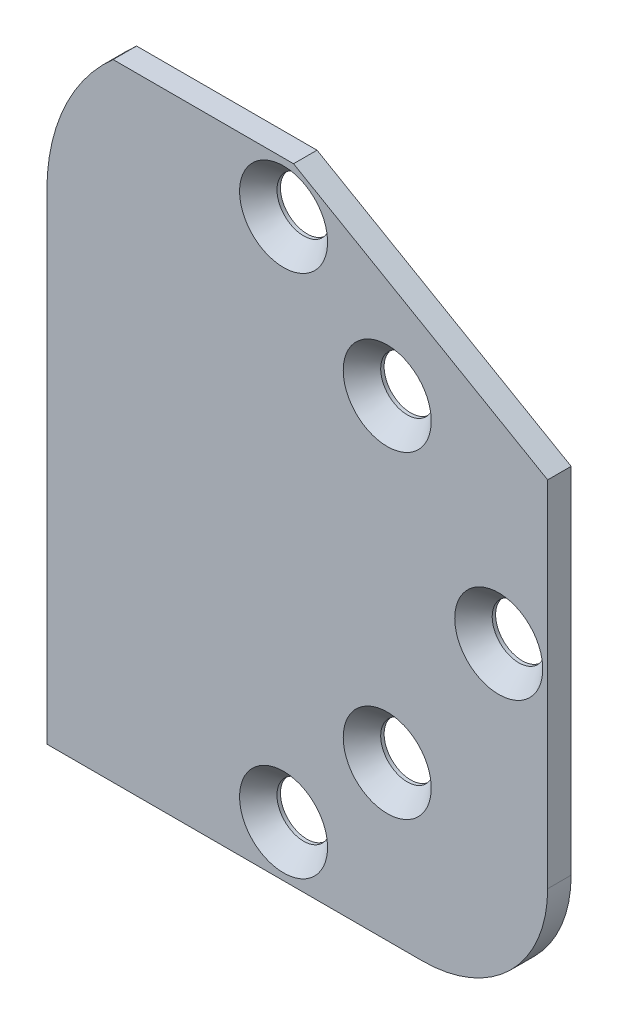
ISO-10303-21;
HEADER;
FILE_DESCRIPTION(('STEP AP214'),'2;1');
FILE_NAME('part.step','',(''),(''),'','','');
FILE_SCHEMA(('AUTOMOTIVE_DESIGN { 1 0 10303 214 1 1 1 1 }'));
ENDSEC;
DATA;
#1=APPLICATION_CONTEXT('core data for automotive mechanical design processes');
#2=APPLICATION_PROTOCOL_DEFINITION('international standard','automotive_design',2000,#1);
#3=PRODUCT_CONTEXT('',#1,'mechanical');
#4=PRODUCT('Part','Part','',(#3));
#5=PRODUCT_RELATED_PRODUCT_CATEGORY('part','',(#4));
#6=PRODUCT_DEFINITION_FORMATION('','',#4);
#7=PRODUCT_DEFINITION_CONTEXT('part definition',#1,'design');
#8=PRODUCT_DEFINITION('design','',#6,#7);
#9=PRODUCT_DEFINITION_SHAPE('','',#8);
#10=(LENGTH_UNIT() NAMED_UNIT(*) SI_UNIT(.MILLI.,.METRE.));
#11=(NAMED_UNIT(*) PLANE_ANGLE_UNIT() SI_UNIT($,.RADIAN.));
#12=(NAMED_UNIT(*) SI_UNIT($,.STERADIAN.) SOLID_ANGLE_UNIT());
#13=UNCERTAINTY_MEASURE_WITH_UNIT(LENGTH_MEASURE(1.E-05),#10,'distance_accuracy_value','');
#14=(GEOMETRIC_REPRESENTATION_CONTEXT(3) GLOBAL_UNCERTAINTY_ASSIGNED_CONTEXT((#13)) GLOBAL_UNIT_ASSIGNED_CONTEXT((#10,
#11,#12)) REPRESENTATION_CONTEXT('',''));
#15=CARTESIAN_POINT('',(0.,0.,0.));
#16=DIRECTION('',(0.,0.,1.));
#17=DIRECTION('',(1.,0.,0.));
#18=AXIS2_PLACEMENT_3D('',#15,#16,#17);
#19=CARTESIAN_POINT('',(22.098,30.63875,0.819082999265145));
#20=DIRECTION('',(0.,0.,1.));
#21=DIRECTION('',(1.,0.,0.));
#22=AXIS2_PLACEMENT_3D('',#19,#20,#21);
#23=CONICAL_SURFACE('',#22,2.244725,0.715584993317675);
#24=DIRECTION('',(0.656059028990507,0.,-0.754709580222772));
#25=VECTOR('',#24,1.);
#26=CARTESIAN_POINT('',(19.8532749999999,30.63875,0.819082999265145));
#27=LINE('',#26,#25);
#28=CARTESIAN_POINT('',(19.2405,30.63875,1.524));
#29=VERTEX_POINT('',#28);
#30=CARTESIAN_POINT('',(20.3707999999999,30.63875,0.22373858931809));
#31=VERTEX_POINT('',#30);
#32=EDGE_CURVE('E11',#29,#31,#27,.T.);
#33=ORIENTED_EDGE('',*,*,#32,.T.);
#34=CARTESIAN_POINT('',(22.098,30.63875,0.22373858931809));
#35=DIRECTION('',(0.,0.,1.));
#36=DIRECTION('',(1.,0.,0.));
#37=AXIS2_PLACEMENT_3D('',#34,#35,#36);
#38=CIRCLE('',#37,1.7272);
#39=EDGE_CURVE('E44',#31,#31,#38,.F.);
#40=ORIENTED_EDGE('',*,*,#39,.T.);
#41=ORIENTED_EDGE('',*,*,#32,.F.);
#42=CARTESIAN_POINT('',(22.098,30.63875,1.524));
#43=DIRECTION('',(0.,0.,-1.));
#44=DIRECTION('',(1.,0.,0.));
#45=AXIS2_PLACEMENT_3D('',#42,#43,#44);
#46=CIRCLE('',#45,2.8575);
#47=EDGE_CURVE('E146',#29,#29,#46,.T.);
#48=ORIENTED_EDGE('',*,*,#47,.F.);
#49=EDGE_LOOP('',(#33,#40,#41,#48));
#50=FACE_BOUND('',#49,.T.);
#51=ADVANCED_FACE('F40',(#50),#23,.F.);
#52=CARTESIAN_POINT('',(15.367,3.302,0.819082999265145));
#53=DIRECTION('',(0.,0.,1.));
#54=DIRECTION('',(1.,0.,0.));
#55=AXIS2_PLACEMENT_3D('',#52,#53,#54);
#56=CONICAL_SURFACE('',#55,2.244725,0.715584993317675);
#57=DIRECTION('',(0.656059028990507,0.,-0.754709580222772));
#58=VECTOR('',#57,1.);
#59=CARTESIAN_POINT('',(13.1222750000001,3.302,0.819082999265145));
#60=LINE('',#59,#58);
#61=CARTESIAN_POINT('',(12.5095,3.302,1.524));
#62=VERTEX_POINT('',#61);
#63=CARTESIAN_POINT('',(13.6398000000001,3.302,0.223738589318092));
#64=VERTEX_POINT('',#63);
#65=EDGE_CURVE('E50',#62,#64,#60,.T.);
#66=ORIENTED_EDGE('',*,*,#65,.T.);
#67=CARTESIAN_POINT('',(15.367,3.302,0.223738589318092));
#68=DIRECTION('',(0.,0.,1.));
#69=DIRECTION('',(1.,0.,0.));
#70=AXIS2_PLACEMENT_3D('',#67,#68,#69);
#71=CIRCLE('',#70,1.7272);
#72=EDGE_CURVE('E217',#64,#64,#71,.F.);
#73=ORIENTED_EDGE('',*,*,#72,.T.);
#74=ORIENTED_EDGE('',*,*,#65,.F.);
#75=CARTESIAN_POINT('',(15.367,3.302,1.524));
#76=DIRECTION('',(0.,0.,-1.));
#77=DIRECTION('',(1.,0.,0.));
#78=AXIS2_PLACEMENT_3D('',#75,#76,#77);
#79=CIRCLE('',#78,2.8575);
#80=EDGE_CURVE('E142',#62,#62,#79,.T.);
#81=ORIENTED_EDGE('',*,*,#80,.F.);
#82=EDGE_LOOP('',(#66,#73,#74,#81));
#83=FACE_BOUND('',#82,.T.);
#84=ADVANCED_FACE('F143',(#83),#56,.F.);
#85=CARTESIAN_POINT('',(15.367,37.338,0.819082999265145));
#86=DIRECTION('',(0.,0.,1.));
#87=DIRECTION('',(1.,0.,0.));
#88=AXIS2_PLACEMENT_3D('',#85,#86,#87);
#89=CONICAL_SURFACE('',#88,2.244725,0.715584993317675);
#90=DIRECTION('',(0.656059028990507,0.,-0.754709580222772));
#91=VECTOR('',#90,1.);
#92=CARTESIAN_POINT('',(13.122275,37.338,0.819082999265145));
#93=LINE('',#92,#91);
#94=CARTESIAN_POINT('',(12.5095,37.338,1.524));
#95=VERTEX_POINT('',#94);
#96=CARTESIAN_POINT('',(13.6398,37.338,0.223738589318092));
#97=VERTEX_POINT('',#96);
#98=EDGE_CURVE('E167',#95,#97,#93,.T.);
#99=ORIENTED_EDGE('',*,*,#98,.T.);
#100=CARTESIAN_POINT('',(15.367,37.338,0.223738589318092));
#101=DIRECTION('',(0.,0.,1.));
#102=DIRECTION('',(1.,0.,0.));
#103=AXIS2_PLACEMENT_3D('',#100,#101,#102);
#104=CIRCLE('',#103,1.7272);
#105=EDGE_CURVE('E59',#97,#97,#104,.F.);
#106=ORIENTED_EDGE('',*,*,#105,.T.);
#107=ORIENTED_EDGE('',*,*,#98,.F.);
#108=CARTESIAN_POINT('',(15.367,37.338,1.524));
#109=DIRECTION('',(0.,0.,-1.));
#110=DIRECTION('',(1.,0.,0.));
#111=AXIS2_PLACEMENT_3D('',#108,#109,#110);
#112=CIRCLE('',#111,2.8575);
#113=EDGE_CURVE('E147',#95,#95,#112,.T.);
#114=ORIENTED_EDGE('',*,*,#113,.F.);
#115=EDGE_LOOP('',(#99,#106,#107,#114));
#116=FACE_BOUND('',#115,.T.);
#117=ADVANCED_FACE('F253',(#116),#89,.F.);
#118=CARTESIAN_POINT('',(22.098,10.00125,0.819082999265145));
#119=DIRECTION('',(0.,0.,1.));
#120=DIRECTION('',(1.,0.,0.));
#121=AXIS2_PLACEMENT_3D('',#118,#119,#120);
#122=CONICAL_SURFACE('',#121,2.244725,0.715584993317675);
#123=DIRECTION('',(0.656059028990507,0.,-0.754709580222772));
#124=VECTOR('',#123,1.);
#125=CARTESIAN_POINT('',(19.8532749999999,10.00125,0.819082999265145));
#126=LINE('',#125,#124);
#127=CARTESIAN_POINT('',(19.2405,10.00125,1.524));
#128=VERTEX_POINT('',#127);
#129=CARTESIAN_POINT('',(20.3707999999999,10.00125,0.22373858931809));
#130=VERTEX_POINT('',#129);
#131=EDGE_CURVE('E209',#128,#130,#126,.T.);
#132=ORIENTED_EDGE('',*,*,#131,.T.);
#133=CARTESIAN_POINT('',(22.098,10.00125,0.22373858931809));
#134=DIRECTION('',(0.,0.,1.));
#135=DIRECTION('',(1.,0.,0.));
#136=AXIS2_PLACEMENT_3D('',#133,#134,#135);
#137=CIRCLE('',#136,1.7272);
#138=EDGE_CURVE('E222',#130,#130,#137,.F.);
#139=ORIENTED_EDGE('',*,*,#138,.T.);
#140=ORIENTED_EDGE('',*,*,#131,.F.);
#141=CARTESIAN_POINT('',(22.098,10.00125,1.524));
#142=DIRECTION('',(0.,0.,-1.));
#143=DIRECTION('',(1.,0.,0.));
#144=AXIS2_PLACEMENT_3D('',#141,#142,#143);
#145=CIRCLE('',#144,2.8575);
#146=EDGE_CURVE('E155',#128,#128,#145,.T.);
#147=ORIENTED_EDGE('',*,*,#146,.F.);
#148=EDGE_LOOP('',(#132,#139,#140,#147));
#149=FACE_BOUND('',#148,.T.);
#150=ADVANCED_FACE('F309',(#149),#122,.F.);
#151=CARTESIAN_POINT('',(29.337,20.32,0.819082999265145));
#152=DIRECTION('',(0.,0.,1.));
#153=DIRECTION('',(1.,0.,0.));
#154=AXIS2_PLACEMENT_3D('',#151,#152,#153);
#155=CONICAL_SURFACE('',#154,2.244725,0.715584993317675);
#156=DIRECTION('',(0.656059028990507,0.,-0.754709580222772));
#157=VECTOR('',#156,1.);
#158=CARTESIAN_POINT('',(27.092275,20.32,0.819082999265145));
#159=LINE('',#158,#157);
#160=CARTESIAN_POINT('',(26.4795,20.32,1.524));
#161=VERTEX_POINT('',#160);
#162=CARTESIAN_POINT('',(27.6098,20.32,0.22373858931809));
#163=VERTEX_POINT('',#162);
#164=EDGE_CURVE('E213',#161,#163,#159,.T.);
#165=ORIENTED_EDGE('',*,*,#164,.T.);
#166=CARTESIAN_POINT('',(29.337,20.32,0.22373858931809));
#167=DIRECTION('',(0.,0.,1.));
#168=DIRECTION('',(1.,0.,0.));
#169=AXIS2_PLACEMENT_3D('',#166,#167,#168);
#170=CIRCLE('',#169,1.7272);
#171=EDGE_CURVE('E268',#163,#163,#170,.F.);
#172=ORIENTED_EDGE('',*,*,#171,.T.);
#173=ORIENTED_EDGE('',*,*,#164,.F.);
#174=CARTESIAN_POINT('',(29.337,20.32,1.524));
#175=DIRECTION('',(0.,0.,-1.));
#176=DIRECTION('',(1.,0.,0.));
#177=AXIS2_PLACEMENT_3D('',#174,#175,#176);
#178=CIRCLE('',#177,2.8575);
#179=EDGE_CURVE('E202',#161,#161,#178,.T.);
#180=ORIENTED_EDGE('',*,*,#179,.F.);
#181=EDGE_LOOP('',(#165,#172,#173,#180));
#182=FACE_BOUND('',#181,.T.);
#183=ADVANCED_FACE('F267',(#182),#155,.F.);
#184=CARTESIAN_POINT('',(16.0142160579064,40.64,0.));
#185=DIRECTION('',(0.,1.,0.));
#186=DIRECTION('',(1.,0.,0.));
#187=AXIS2_PLACEMENT_3D('',#184,#185,#186);
#188=PLANE('',#187);
#189=DIRECTION('',(1.,0.,0.));
#190=VECTOR('',#189,1.);
#191=CARTESIAN_POINT('',(4.29973958736992,40.64,0.));
#192=LINE('',#191,#190);
#193=CARTESIAN_POINT('',(4.29973958736992,40.64,0.));
#194=VERTEX_POINT('',#193);
#195=CARTESIAN_POINT('',(16.0142160579064,40.64,0.));
#196=VERTEX_POINT('',#195);
#197=EDGE_CURVE('E185',#194,#196,#192,.T.);
#198=ORIENTED_EDGE('',*,*,#197,.F.);
#199=DIRECTION('',(0.,0.,1.));
#200=VECTOR('',#199,1.);
#201=CARTESIAN_POINT('',(4.29973958736992,40.64,0.));
#202=LINE('',#201,#200);
#203=CARTESIAN_POINT('',(4.29973958736992,40.64,1.524));
#204=VERTEX_POINT('',#203);
#205=EDGE_CURVE('E191',#194,#204,#202,.T.);
#206=ORIENTED_EDGE('',*,*,#205,.T.);
#207=DIRECTION('',(-1.,0.,0.));
#208=VECTOR('',#207,1.);
#209=CARTESIAN_POINT('',(4.29973958736992,40.64,1.524));
#210=LINE('',#209,#208);
#211=CARTESIAN_POINT('',(16.0142160579064,40.64,1.524));
#212=VERTEX_POINT('',#211);
#213=EDGE_CURVE('E151',#212,#204,#210,.T.);
#214=ORIENTED_EDGE('',*,*,#213,.F.);
#215=DIRECTION('',(0.,0.,1.));
#216=VECTOR('',#215,1.);
#217=CARTESIAN_POINT('',(16.0142160579064,40.64,0.));
#218=LINE('',#217,#216);
#219=EDGE_CURVE('E187',#196,#212,#218,.T.);
#220=ORIENTED_EDGE('',*,*,#219,.F.);
#221=EDGE_LOOP('',(#198,#206,#214,#220));
#222=FACE_BOUND('',#221,.T.);
#223=ADVANCED_FACE('F316',(#222),#188,.T.);
#224=CARTESIAN_POINT('',(32.512,31.115,0.));
#225=DIRECTION('',(0.5,0.866025403784439,0.));
#226=DIRECTION('',(0.,0.,-1.));
#227=AXIS2_PLACEMENT_3D('',#224,#225,#226);
#228=PLANE('',#227);
#229=DIRECTION('',(0.866025403784439,-0.5,0.));
#230=VECTOR('',#229,1.);
#231=CARTESIAN_POINT('',(16.0142160579064,40.64,0.));
#232=LINE('',#231,#230);
#233=CARTESIAN_POINT('',(32.512,31.115,0.));
#234=VERTEX_POINT('',#233);
#235=EDGE_CURVE('E182',#196,#234,#232,.T.);
#236=ORIENTED_EDGE('',*,*,#235,.F.);
#237=ORIENTED_EDGE('',*,*,#219,.T.);
#238=DIRECTION('',(-0.866025403784439,0.5,0.));
#239=VECTOR('',#238,1.);
#240=CARTESIAN_POINT('',(16.0142160579064,40.64,1.524));
#241=LINE('',#240,#239);
#242=CARTESIAN_POINT('',(32.512,31.115,1.524));
#243=VERTEX_POINT('',#242);
#244=EDGE_CURVE('E161',#243,#212,#241,.T.);
#245=ORIENTED_EDGE('',*,*,#244,.F.);
#246=DIRECTION('',(0.,0.,1.));
#247=VECTOR('',#246,1.);
#248=CARTESIAN_POINT('',(32.512,31.115,0.));
#249=LINE('',#248,#247);
#250=EDGE_CURVE('E192',#234,#243,#249,.T.);
#251=ORIENTED_EDGE('',*,*,#250,.F.);
#252=EDGE_LOOP('',(#236,#237,#245,#251));
#253=FACE_BOUND('',#252,.T.);
#254=ADVANCED_FACE('F42',(#253),#228,.T.);
#255=CARTESIAN_POINT('',(32.512,8.128,0.));
#256=DIRECTION('',(1.,0.,0.));
#257=DIRECTION('',(0.,1.,0.));
#258=AXIS2_PLACEMENT_3D('',#255,#256,#257);
#259=PLANE('',#258);
#260=DIRECTION('',(0.,-1.,0.));
#261=VECTOR('',#260,1.);
#262=CARTESIAN_POINT('',(32.512,31.115,0.));
#263=LINE('',#262,#261);
#264=CARTESIAN_POINT('',(32.512,8.128,0.));
#265=VERTEX_POINT('',#264);
#266=EDGE_CURVE('E186',#234,#265,#263,.T.);
#267=ORIENTED_EDGE('',*,*,#266,.F.);
#268=ORIENTED_EDGE('',*,*,#250,.T.);
#269=DIRECTION('',(0.,1.,0.));
#270=VECTOR('',#269,1.);
#271=CARTESIAN_POINT('',(32.512,31.115,1.524));
#272=LINE('',#271,#270);
#273=CARTESIAN_POINT('',(32.512,8.128,1.524));
#274=VERTEX_POINT('',#273);
#275=EDGE_CURVE('E165',#274,#243,#272,.T.);
#276=ORIENTED_EDGE('',*,*,#275,.F.);
#277=DIRECTION('',(0.,0.,1.));
#278=VECTOR('',#277,1.);
#279=CARTESIAN_POINT('',(32.512,8.128,0.));
#280=LINE('',#279,#278);
#281=EDGE_CURVE('E196',#265,#274,#280,.T.);
#282=ORIENTED_EDGE('',*,*,#281,.F.);
#283=EDGE_LOOP('',(#267,#268,#276,#282));
#284=FACE_BOUND('',#283,.T.);
#285=ADVANCED_FACE('F323',(#284),#259,.T.);
#286=CARTESIAN_POINT('',(24.384,8.128,0.));
#287=DIRECTION('',(0.,0.,1.));
#288=DIRECTION('',(0.,-1.,0.));
#289=AXIS2_PLACEMENT_3D('',#286,#287,#288);
#290=CYLINDRICAL_SURFACE('',#289,8.128);
#291=CARTESIAN_POINT('',(24.384,8.128,0.));
#292=DIRECTION('',(0.,0.,1.));
#293=DIRECTION('',(0.,-1.,0.));
#294=AXIS2_PLACEMENT_3D('',#291,#292,#293);
#295=CIRCLE('',#294,8.128);
#296=CARTESIAN_POINT('',(24.384,0.,0.));
#297=VERTEX_POINT('',#296);
#298=EDGE_CURVE('E193',#297,#265,#295,.T.);
#299=ORIENTED_EDGE('',*,*,#298,.T.);
#300=ORIENTED_EDGE('',*,*,#281,.T.);
#301=CARTESIAN_POINT('',(24.384,8.128,1.524));
#302=DIRECTION('',(0.,0.,1.));
#303=DIRECTION('',(0.,-1.,0.));
#304=AXIS2_PLACEMENT_3D('',#301,#302,#303);
#305=CIRCLE('',#304,8.128);
#306=CARTESIAN_POINT('',(24.384,0.,1.524));
#307=VERTEX_POINT('',#306);
#308=EDGE_CURVE('E176',#307,#274,#305,.T.);
#309=ORIENTED_EDGE('',*,*,#308,.F.);
#310=DIRECTION('',(0.,0.,1.));
#311=VECTOR('',#310,1.);
#312=CARTESIAN_POINT('',(24.384,0.,0.));
#313=LINE('',#312,#311);
#314=EDGE_CURVE('E201',#297,#307,#313,.T.);
#315=ORIENTED_EDGE('',*,*,#314,.F.);
#316=EDGE_LOOP('',(#299,#300,#309,#315));
#317=FACE_BOUND('',#316,.T.);
#318=ADVANCED_FACE('F347',(#317),#290,.T.);
#319=CARTESIAN_POINT('',(0.,0.,0.));
#320=DIRECTION('',(0.,-1.,0.));
#321=DIRECTION('',(0.,0.,-1.));
#322=AXIS2_PLACEMENT_3D('',#319,#320,#321);
#323=PLANE('',#322);
#324=DIRECTION('',(-1.,0.,0.));
#325=VECTOR('',#324,1.);
#326=CARTESIAN_POINT('',(24.384,0.,0.));
#327=LINE('',#326,#325);
#328=CARTESIAN_POINT('',(0.,0.,0.));
#329=VERTEX_POINT('',#328);
#330=EDGE_CURVE('E220',#297,#329,#327,.T.);
#331=ORIENTED_EDGE('',*,*,#330,.F.);
#332=ORIENTED_EDGE('',*,*,#314,.T.);
#333=DIRECTION('',(1.,0.,0.));
#334=VECTOR('',#333,1.);
#335=CARTESIAN_POINT('',(24.384,0.,1.524));
#336=LINE('',#335,#334);
#337=CARTESIAN_POINT('',(0.,0.,1.524));
#338=VERTEX_POINT('',#337);
#339=EDGE_CURVE('E178',#338,#307,#336,.T.);
#340=ORIENTED_EDGE('',*,*,#339,.F.);
#341=DIRECTION('',(0.,0.,1.));
#342=VECTOR('',#341,1.);
#343=CARTESIAN_POINT('',(0.,0.,0.));
#344=LINE('',#343,#342);
#345=EDGE_CURVE('E159',#329,#338,#344,.T.);
#346=ORIENTED_EDGE('',*,*,#345,.F.);
#347=EDGE_LOOP('',(#331,#332,#340,#346));
#348=FACE_BOUND('',#347,.T.);
#349=ADVANCED_FACE('F349',(#348),#323,.T.);
#350=CARTESIAN_POINT('',(0.,31.115,0.));
#351=DIRECTION('',(-1.,0.,0.));
#352=DIRECTION('',(0.,0.,1.));
#353=AXIS2_PLACEMENT_3D('',#350,#351,#352);
#354=PLANE('',#353);
#355=DIRECTION('',(0.,1.,0.));
#356=VECTOR('',#355,1.);
#357=CARTESIAN_POINT('',(0.,0.,0.));
#358=LINE('',#357,#356);
#359=CARTESIAN_POINT('',(0.,31.115,0.));
#360=VERTEX_POINT('',#359);
#361=EDGE_CURVE('E218',#329,#360,#358,.T.);
#362=ORIENTED_EDGE('',*,*,#361,.F.);
#363=ORIENTED_EDGE('',*,*,#345,.T.);
#364=DIRECTION('',(0.,-1.,0.));
#365=VECTOR('',#364,1.);
#366=CARTESIAN_POINT('',(0.,0.,1.524));
#367=LINE('',#366,#365);
#368=CARTESIAN_POINT('',(0.,31.115,1.524));
#369=VERTEX_POINT('',#368);
#370=EDGE_CURVE('E172',#369,#338,#367,.T.);
#371=ORIENTED_EDGE('',*,*,#370,.F.);
#372=DIRECTION('',(0.,0.,1.));
#373=VECTOR('',#372,1.);
#374=CARTESIAN_POINT('',(0.,31.115,0.));
#375=LINE('',#374,#373);
#376=EDGE_CURVE('E171',#360,#369,#375,.T.);
#377=ORIENTED_EDGE('',*,*,#376,.F.);
#378=EDGE_LOOP('',(#362,#363,#371,#377));
#379=FACE_BOUND('',#378,.T.);
#380=ADVANCED_FACE('F340',(#379),#354,.T.);
#381=CARTESIAN_POINT('',(12.7,31.115,0.));
#382=DIRECTION('',(0.,0.,1.));
#383=DIRECTION('',(-0.661437827766147,0.75,0.));
#384=AXIS2_PLACEMENT_3D('',#381,#382,#383);
#385=CYLINDRICAL_SURFACE('',#384,12.7);
#386=CARTESIAN_POINT('',(12.7,31.115,0.));
#387=DIRECTION('',(0.,0.,1.));
#388=DIRECTION('',(-0.661437827766147,0.75,0.));
#389=AXIS2_PLACEMENT_3D('',#386,#387,#388);
#390=CIRCLE('',#389,12.7);
#391=EDGE_CURVE('E175',#194,#360,#390,.T.);
#392=ORIENTED_EDGE('',*,*,#391,.T.);
#393=ORIENTED_EDGE('',*,*,#376,.T.);
#394=CARTESIAN_POINT('',(12.7,31.115,1.524));
#395=DIRECTION('',(0.,0.,1.));
#396=DIRECTION('',(-0.661437827766147,0.75,0.));
#397=AXIS2_PLACEMENT_3D('',#394,#395,#396);
#398=CIRCLE('',#397,12.7);
#399=EDGE_CURVE('E168',#204,#369,#398,.T.);
#400=ORIENTED_EDGE('',*,*,#399,.F.);
#401=ORIENTED_EDGE('',*,*,#205,.F.);
#402=EDGE_LOOP('',(#392,#393,#400,#401));
#403=FACE_BOUND('',#402,.T.);
#404=ADVANCED_FACE('F259',(#403),#385,.T.);
#405=CARTESIAN_POINT('',(16.256,20.32,1.524));
#406=DIRECTION('',(0.,0.,1.));
#407=DIRECTION('',(1.,0.,0.));
#408=AXIS2_PLACEMENT_3D('',#405,#406,#407);
#409=PLANE('',#408);
#410=ORIENTED_EDGE('',*,*,#399,.T.);
#411=ORIENTED_EDGE('',*,*,#370,.T.);
#412=ORIENTED_EDGE('',*,*,#339,.T.);
#413=ORIENTED_EDGE('',*,*,#308,.T.);
#414=ORIENTED_EDGE('',*,*,#275,.T.);
#415=ORIENTED_EDGE('',*,*,#244,.T.);
#416=ORIENTED_EDGE('',*,*,#213,.T.);
#417=EDGE_LOOP('',(#410,#411,#412,#413,#414,#415,#416));
#418=FACE_BOUND('',#417,.T.);
#419=ORIENTED_EDGE('',*,*,#47,.T.);
#420=EDGE_LOOP('',(#419));
#421=FACE_BOUND('',#420,.T.);
#422=ORIENTED_EDGE('',*,*,#80,.T.);
#423=EDGE_LOOP('',(#422));
#424=FACE_BOUND('',#423,.T.);
#425=ORIENTED_EDGE('',*,*,#113,.T.);
#426=EDGE_LOOP('',(#425));
#427=FACE_BOUND('',#426,.T.);
#428=ORIENTED_EDGE('',*,*,#146,.T.);
#429=EDGE_LOOP('',(#428));
#430=FACE_BOUND('',#429,.T.);
#431=ORIENTED_EDGE('',*,*,#179,.T.);
#432=EDGE_LOOP('',(#431));
#433=FACE_BOUND('',#432,.T.);
#434=ADVANCED_FACE('F255',(#418,#421,#424,#427,#430,#433),#409,.T.);
#435=CARTESIAN_POINT('',(16.256,20.32,0.));
#436=DIRECTION('',(0.,0.,1.));
#437=DIRECTION('',(1.,0.,0.));
#438=AXIS2_PLACEMENT_3D('',#435,#436,#437);
#439=PLANE('',#438);
#440=CARTESIAN_POINT('',(15.367,37.338,0.));
#441=DIRECTION('',(0.,0.,1.));
#442=DIRECTION('',(1.,0.,0.));
#443=AXIS2_PLACEMENT_3D('',#440,#441,#442);
#444=CIRCLE('',#443,1.7272);
#445=CARTESIAN_POINT('',(17.0942,37.338,0.));
#446=VERTEX_POINT('',#445);
#447=EDGE_CURVE('E284',#446,#446,#444,.T.);
#448=ORIENTED_EDGE('',*,*,#447,.T.);
#449=EDGE_LOOP('',(#448));
#450=FACE_BOUND('',#449,.T.);
#451=CARTESIAN_POINT('',(22.098,30.63875,0.));
#452=DIRECTION('',(0.,0.,1.));
#453=DIRECTION('',(1.,0.,0.));
#454=AXIS2_PLACEMENT_3D('',#451,#452,#453);
#455=CIRCLE('',#454,1.7272);
#456=CARTESIAN_POINT('',(23.8252,30.63875,0.));
#457=VERTEX_POINT('',#456);
#458=EDGE_CURVE('E279',#457,#457,#455,.T.);
#459=ORIENTED_EDGE('',*,*,#458,.T.);
#460=EDGE_LOOP('',(#459));
#461=FACE_BOUND('',#460,.T.);
#462=CARTESIAN_POINT('',(29.337,20.32,0.));
#463=DIRECTION('',(0.,0.,1.));
#464=DIRECTION('',(1.,0.,0.));
#465=AXIS2_PLACEMENT_3D('',#462,#463,#464);
#466=CIRCLE('',#465,1.7272);
#467=CARTESIAN_POINT('',(31.0642,20.32,0.));
#468=VERTEX_POINT('',#467);
#469=EDGE_CURVE('E271',#468,#468,#466,.T.);
#470=ORIENTED_EDGE('',*,*,#469,.T.);
#471=EDGE_LOOP('',(#470));
#472=FACE_BOUND('',#471,.T.);
#473=CARTESIAN_POINT('',(22.098,10.00125,0.));
#474=DIRECTION('',(0.,0.,1.));
#475=DIRECTION('',(1.,0.,0.));
#476=AXIS2_PLACEMENT_3D('',#473,#474,#475);
#477=CIRCLE('',#476,1.7272);
#478=CARTESIAN_POINT('',(23.8252,10.00125,0.));
#479=VERTEX_POINT('',#478);
#480=EDGE_CURVE('E228',#479,#479,#477,.T.);
#481=ORIENTED_EDGE('',*,*,#480,.T.);
#482=EDGE_LOOP('',(#481));
#483=FACE_BOUND('',#482,.T.);
#484=CARTESIAN_POINT('',(15.367,3.302,0.));
#485=DIRECTION('',(0.,0.,1.));
#486=DIRECTION('',(1.,0.,0.));
#487=AXIS2_PLACEMENT_3D('',#484,#485,#486);
#488=CIRCLE('',#487,1.7272);
#489=CARTESIAN_POINT('',(17.0942,3.302,0.));
#490=VERTEX_POINT('',#489);
#491=EDGE_CURVE('E219',#490,#490,#488,.T.);
#492=ORIENTED_EDGE('',*,*,#491,.T.);
#493=EDGE_LOOP('',(#492));
#494=FACE_BOUND('',#493,.T.);
#495=ORIENTED_EDGE('',*,*,#391,.F.);
#496=ORIENTED_EDGE('',*,*,#197,.T.);
#497=ORIENTED_EDGE('',*,*,#235,.T.);
#498=ORIENTED_EDGE('',*,*,#266,.T.);
#499=ORIENTED_EDGE('',*,*,#298,.F.);
#500=ORIENTED_EDGE('',*,*,#330,.T.);
#501=ORIENTED_EDGE('',*,*,#361,.T.);
#502=EDGE_LOOP('',(#495,#496,#497,#498,#499,#500,#501));
#503=FACE_BOUND('',#502,.T.);
#504=ADVANCED_FACE('F258',(#450,#461,#472,#483,#494,#503),#439,.F.);
#505=CARTESIAN_POINT('',(15.367,3.302,1.524));
#506=DIRECTION('',(0.,0.,1.));
#507=DIRECTION('',(1.,0.,0.));
#508=AXIS2_PLACEMENT_3D('',#505,#506,#507);
#509=CYLINDRICAL_SURFACE('',#508,1.7272);
#510=ORIENTED_EDGE('',*,*,#491,.F.);
#511=EDGE_LOOP('',(#510));
#512=FACE_BOUND('',#511,.T.);
#513=ORIENTED_EDGE('',*,*,#72,.F.);
#514=EDGE_LOOP('',(#513));
#515=FACE_BOUND('',#514,.T.);
#516=ADVANCED_FACE('F314',(#512,#515),#509,.F.);
#517=CARTESIAN_POINT('',(22.098,10.00125,1.524));
#518=DIRECTION('',(0.,0.,1.));
#519=DIRECTION('',(1.,0.,0.));
#520=AXIS2_PLACEMENT_3D('',#517,#518,#519);
#521=CYLINDRICAL_SURFACE('',#520,1.7272);
#522=ORIENTED_EDGE('',*,*,#480,.F.);
#523=EDGE_LOOP('',(#522));
#524=FACE_BOUND('',#523,.T.);
#525=ORIENTED_EDGE('',*,*,#138,.F.);
#526=EDGE_LOOP('',(#525));
#527=FACE_BOUND('',#526,.T.);
#528=ADVANCED_FACE('F383',(#524,#527),#521,.F.);
#529=CARTESIAN_POINT('',(29.337,20.32,1.524));
#530=DIRECTION('',(0.,0.,1.));
#531=DIRECTION('',(1.,0.,0.));
#532=AXIS2_PLACEMENT_3D('',#529,#530,#531);
#533=CYLINDRICAL_SURFACE('',#532,1.7272);
#534=ORIENTED_EDGE('',*,*,#469,.F.);
#535=EDGE_LOOP('',(#534));
#536=FACE_BOUND('',#535,.T.);
#537=ORIENTED_EDGE('',*,*,#171,.F.);
#538=EDGE_LOOP('',(#537));
#539=FACE_BOUND('',#538,.T.);
#540=ADVANCED_FACE('F298',(#536,#539),#533,.F.);
#541=CARTESIAN_POINT('',(22.098,30.63875,1.524));
#542=DIRECTION('',(0.,0.,1.));
#543=DIRECTION('',(1.,0.,0.));
#544=AXIS2_PLACEMENT_3D('',#541,#542,#543);
#545=CYLINDRICAL_SURFACE('',#544,1.7272);
#546=ORIENTED_EDGE('',*,*,#458,.F.);
#547=EDGE_LOOP('',(#546));
#548=FACE_BOUND('',#547,.T.);
#549=ORIENTED_EDGE('',*,*,#39,.F.);
#550=EDGE_LOOP('',(#549));
#551=FACE_BOUND('',#550,.T.);
#552=ADVANCED_FACE('F293',(#548,#551),#545,.F.);
#553=CARTESIAN_POINT('',(15.367,37.338,1.524));
#554=DIRECTION('',(0.,0.,1.));
#555=DIRECTION('',(1.,0.,0.));
#556=AXIS2_PLACEMENT_3D('',#553,#554,#555);
#557=CYLINDRICAL_SURFACE('',#556,1.7272);
#558=ORIENTED_EDGE('',*,*,#447,.F.);
#559=EDGE_LOOP('',(#558));
#560=FACE_BOUND('',#559,.T.);
#561=ORIENTED_EDGE('',*,*,#105,.F.);
#562=EDGE_LOOP('',(#561));
#563=FACE_BOUND('',#562,.T.);
#564=ADVANCED_FACE('F291',(#560,#563),#557,.F.);
#565=CLOSED_SHELL('',(#51,#84,#117,#150,#183,#223,#254,#285,#318,#349,#380,#404,#434,#504,#516,
#528,#540,#552,#564));
#566=MANIFOLD_SOLID_BREP('B2',#565);
#567=ADVANCED_BREP_SHAPE_REPRESENTATION('',(#18,#566),#14);
#568=SHAPE_DEFINITION_REPRESENTATION(#9,#567);
ENDSEC;
END-ISO-10303-21;
